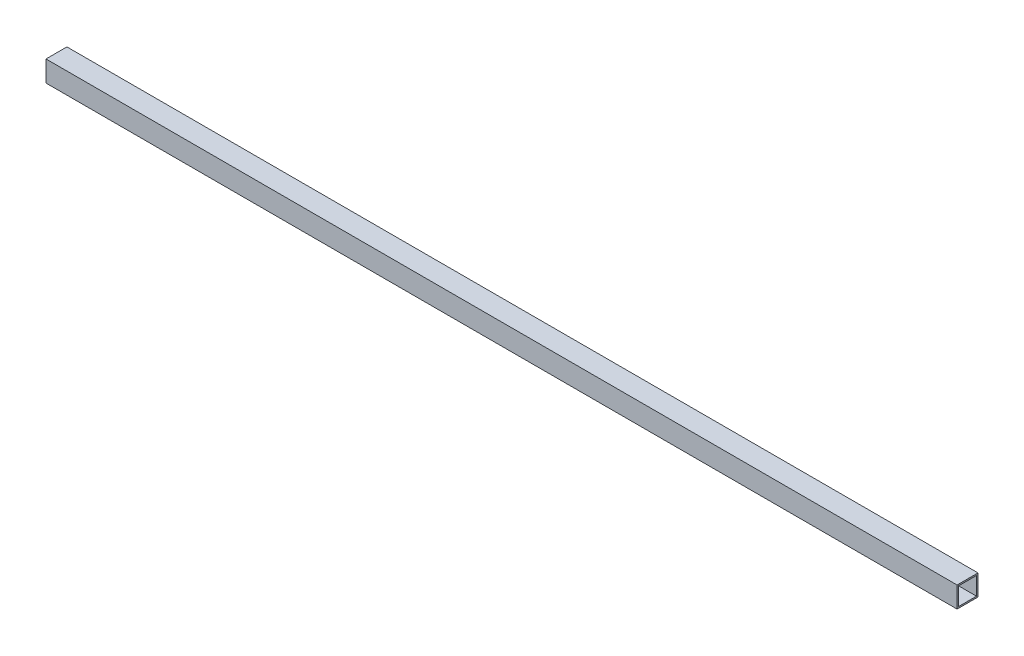
ISO-10303-21;
HEADER;
FILE_DESCRIPTION(('STEP AP214'),'2;1');
FILE_NAME('part.step','',(''),(''),'','','');
FILE_SCHEMA(('AUTOMOTIVE_DESIGN { 1 0 10303 214 1 1 1 1 }'));
ENDSEC;
DATA;
#1=APPLICATION_CONTEXT('core data for automotive mechanical design processes');
#2=APPLICATION_PROTOCOL_DEFINITION('international standard','automotive_design',2000,#1);
#3=PRODUCT_CONTEXT('',#1,'mechanical');
#4=PRODUCT('Part','Part','',(#3));
#5=PRODUCT_RELATED_PRODUCT_CATEGORY('part','',(#4));
#6=PRODUCT_DEFINITION_FORMATION('','',#4);
#7=PRODUCT_DEFINITION_CONTEXT('part definition',#1,'design');
#8=PRODUCT_DEFINITION('design','',#6,#7);
#9=PRODUCT_DEFINITION_SHAPE('','',#8);
#10=(LENGTH_UNIT() NAMED_UNIT(*) SI_UNIT(.MILLI.,.METRE.));
#11=(NAMED_UNIT(*) PLANE_ANGLE_UNIT() SI_UNIT($,.RADIAN.));
#12=(NAMED_UNIT(*) SI_UNIT($,.STERADIAN.) SOLID_ANGLE_UNIT());
#13=UNCERTAINTY_MEASURE_WITH_UNIT(LENGTH_MEASURE(1.E-05),#10,'distance_accuracy_value','');
#14=(GEOMETRIC_REPRESENTATION_CONTEXT(3) GLOBAL_UNCERTAINTY_ASSIGNED_CONTEXT((#13)) GLOBAL_UNIT_ASSIGNED_CONTEXT((#10,
#11,#12)) REPRESENTATION_CONTEXT('',''));
#15=CARTESIAN_POINT('',(0.,0.,0.));
#16=DIRECTION('',(0.,0.,1.));
#17=DIRECTION('',(1.,0.,0.));
#18=AXIS2_PLACEMENT_3D('',#15,#16,#17);
#19=CARTESIAN_POINT('',(1936.75,0.,0.));
#20=DIRECTION('',(-1.,0.,0.));
#21=DIRECTION('',(0.,0.,1.));
#22=AXIS2_PLACEMENT_3D('',#19,#20,#21);
#23=PLANE('',#22);
#24=DIRECTION('',(0.,-1.,0.));
#25=VECTOR('',#24,1.);
#26=CARTESIAN_POINT('',(1936.75,0.,0.));
#27=LINE('',#26,#25);
#28=CARTESIAN_POINT('',(1936.75,44.45,0.));
#29=VERTEX_POINT('',#28);
#30=CARTESIAN_POINT('',(1936.75,0.,0.));
#31=VERTEX_POINT('',#30);
#32=EDGE_CURVE('E138',#29,#31,#27,.T.);
#33=ORIENTED_EDGE('',*,*,#32,.T.);
#34=DIRECTION('',(0.,0.,-1.));
#35=VECTOR('',#34,1.);
#36=CARTESIAN_POINT('',(1936.75,0.,0.));
#37=LINE('',#36,#35);
#38=CARTESIAN_POINT('',(1936.75,0.,-44.45));
#39=VERTEX_POINT('',#38);
#40=EDGE_CURVE('E141',#31,#39,#37,.T.);
#41=ORIENTED_EDGE('',*,*,#40,.T.);
#42=DIRECTION('',(0.,1.,0.));
#43=VECTOR('',#42,1.);
#44=CARTESIAN_POINT('',(1936.75,0.,-44.45));
#45=LINE('',#44,#43);
#46=CARTESIAN_POINT('',(1936.75,44.45,-44.45));
#47=VERTEX_POINT('',#46);
#48=EDGE_CURVE('E144',#39,#47,#45,.T.);
#49=ORIENTED_EDGE('',*,*,#48,.T.);
#50=DIRECTION('',(0.,0.,1.));
#51=VECTOR('',#50,1.);
#52=CARTESIAN_POINT('',(1936.75,44.45,0.));
#53=LINE('',#52,#51);
#54=EDGE_CURVE('E146',#47,#29,#53,.T.);
#55=ORIENTED_EDGE('',*,*,#54,.T.);
#56=EDGE_LOOP('',(#33,#41,#49,#55));
#57=FACE_BOUND('',#56,.T.);
#58=DIRECTION('',(0.,-1.,0.));
#59=VECTOR('',#58,1.);
#60=CARTESIAN_POINT('',(1936.75,41.275,-3.175));
#61=LINE('',#60,#59);
#62=CARTESIAN_POINT('',(1936.75,41.275,-3.175));
#63=VERTEX_POINT('',#62);
#64=CARTESIAN_POINT('',(1936.75,3.175,-3.175));
#65=VERTEX_POINT('',#64);
#66=EDGE_CURVE('E102',#63,#65,#61,.T.);
#67=ORIENTED_EDGE('',*,*,#66,.F.);
#68=DIRECTION('',(0.,0.,1.));
#69=VECTOR('',#68,1.);
#70=CARTESIAN_POINT('',(1936.75,41.275,-3.175));
#71=LINE('',#70,#69);
#72=CARTESIAN_POINT('',(1936.75,41.275,-41.275));
#73=VERTEX_POINT('',#72);
#74=EDGE_CURVE('E124',#73,#63,#71,.T.);
#75=ORIENTED_EDGE('',*,*,#74,.F.);
#76=DIRECTION('',(0.,1.,0.));
#77=VECTOR('',#76,1.);
#78=CARTESIAN_POINT('',(1936.75,41.275,-41.275));
#79=LINE('',#78,#77);
#80=CARTESIAN_POINT('',(1936.75,3.175,-41.275));
#81=VERTEX_POINT('',#80);
#82=EDGE_CURVE('E122',#81,#73,#79,.T.);
#83=ORIENTED_EDGE('',*,*,#82,.F.);
#84=DIRECTION('',(0.,0.,-1.));
#85=VECTOR('',#84,1.);
#86=CARTESIAN_POINT('',(1936.75,3.175,-3.175));
#87=LINE('',#86,#85);
#88=EDGE_CURVE('E110',#65,#81,#87,.T.);
#89=ORIENTED_EDGE('',*,*,#88,.F.);
#90=EDGE_LOOP('',(#67,#75,#83,#89));
#91=FACE_BOUND('',#90,.T.);
#92=ADVANCED_FACE('F37',(#57,#91),#23,.F.);
#93=CARTESIAN_POINT('',(0.,0.,0.));
#94=DIRECTION('',(-1.,0.,0.));
#95=DIRECTION('',(0.,0.,1.));
#96=AXIS2_PLACEMENT_3D('',#93,#94,#95);
#97=PLANE('',#96);
#98=DIRECTION('',(0.,-1.,0.));
#99=VECTOR('',#98,1.);
#100=CARTESIAN_POINT('',(0.,0.,0.));
#101=LINE('',#100,#99);
#102=CARTESIAN_POINT('',(0.,44.45,0.));
#103=VERTEX_POINT('',#102);
#104=CARTESIAN_POINT('',(0.,0.,0.));
#105=VERTEX_POINT('',#104);
#106=EDGE_CURVE('E118',#103,#105,#101,.T.);
#107=ORIENTED_EDGE('',*,*,#106,.F.);
#108=DIRECTION('',(0.,0.,1.));
#109=VECTOR('',#108,1.);
#110=CARTESIAN_POINT('',(0.,44.45,0.));
#111=LINE('',#110,#109);
#112=CARTESIAN_POINT('',(0.,44.45,-44.45));
#113=VERTEX_POINT('',#112);
#114=EDGE_CURVE('E142',#113,#103,#111,.T.);
#115=ORIENTED_EDGE('',*,*,#114,.F.);
#116=DIRECTION('',(0.,1.,0.));
#117=VECTOR('',#116,1.);
#118=CARTESIAN_POINT('',(0.,0.,-44.45));
#119=LINE('',#118,#117);
#120=CARTESIAN_POINT('',(0.,0.,-44.45));
#121=VERTEX_POINT('',#120);
#122=EDGE_CURVE('E153',#121,#113,#119,.T.);
#123=ORIENTED_EDGE('',*,*,#122,.F.);
#124=DIRECTION('',(0.,0.,-1.));
#125=VECTOR('',#124,1.);
#126=CARTESIAN_POINT('',(0.,0.,0.));
#127=LINE('',#126,#125);
#128=EDGE_CURVE('E151',#105,#121,#127,.T.);
#129=ORIENTED_EDGE('',*,*,#128,.F.);
#130=EDGE_LOOP('',(#107,#115,#123,#129));
#131=FACE_BOUND('',#130,.T.);
#132=DIRECTION('',(0.,0.,1.));
#133=VECTOR('',#132,1.);
#134=CARTESIAN_POINT('',(0.,41.275,-3.175));
#135=LINE('',#134,#133);
#136=CARTESIAN_POINT('',(0.,41.275,-41.275));
#137=VERTEX_POINT('',#136);
#138=CARTESIAN_POINT('',(0.,41.275,-3.175));
#139=VERTEX_POINT('',#138);
#140=EDGE_CURVE('E111',#137,#139,#135,.T.);
#141=ORIENTED_EDGE('',*,*,#140,.T.);
#142=DIRECTION('',(0.,-1.,0.));
#143=VECTOR('',#142,1.);
#144=CARTESIAN_POINT('',(0.,41.275,-3.175));
#145=LINE('',#144,#143);
#146=CARTESIAN_POINT('',(0.,3.175,-3.175));
#147=VERTEX_POINT('',#146);
#148=EDGE_CURVE('E60',#139,#147,#145,.T.);
#149=ORIENTED_EDGE('',*,*,#148,.T.);
#150=DIRECTION('',(0.,0.,-1.));
#151=VECTOR('',#150,1.);
#152=CARTESIAN_POINT('',(0.,3.175,-3.175));
#153=LINE('',#152,#151);
#154=CARTESIAN_POINT('',(0.,3.175,-41.275));
#155=VERTEX_POINT('',#154);
#156=EDGE_CURVE('E117',#147,#155,#153,.T.);
#157=ORIENTED_EDGE('',*,*,#156,.T.);
#158=DIRECTION('',(0.,1.,0.));
#159=VECTOR('',#158,1.);
#160=CARTESIAN_POINT('',(0.,41.275,-41.275));
#161=LINE('',#160,#159);
#162=EDGE_CURVE('E130',#155,#137,#161,.T.);
#163=ORIENTED_EDGE('',*,*,#162,.T.);
#164=EDGE_LOOP('',(#141,#149,#157,#163));
#165=FACE_BOUND('',#164,.T.);
#166=ADVANCED_FACE('F171',(#131,#165),#97,.T.);
#167=CARTESIAN_POINT('',(1936.75,0.,0.));
#168=DIRECTION('',(0.,0.,-1.));
#169=DIRECTION('',(-1.,0.,0.));
#170=AXIS2_PLACEMENT_3D('',#167,#168,#169);
#171=PLANE('',#170);
#172=ORIENTED_EDGE('',*,*,#106,.T.);
#173=DIRECTION('',(-1.,0.,0.));
#174=VECTOR('',#173,1.);
#175=CARTESIAN_POINT('',(1936.75,0.,0.));
#176=LINE('',#175,#174);
#177=EDGE_CURVE('E11',#31,#105,#176,.T.);
#178=ORIENTED_EDGE('',*,*,#177,.F.);
#179=ORIENTED_EDGE('',*,*,#32,.F.);
#180=DIRECTION('',(-1.,0.,0.));
#181=VECTOR('',#180,1.);
#182=CARTESIAN_POINT('',(1936.75,44.45,0.));
#183=LINE('',#182,#181);
#184=EDGE_CURVE('E148',#29,#103,#183,.T.);
#185=ORIENTED_EDGE('',*,*,#184,.T.);
#186=EDGE_LOOP('',(#172,#178,#179,#185));
#187=FACE_BOUND('',#186,.T.);
#188=ADVANCED_FACE('F39',(#187),#171,.F.);
#189=CARTESIAN_POINT('',(1936.75,0.,0.));
#190=DIRECTION('',(0.,1.,0.));
#191=DIRECTION('',(0.,0.,1.));
#192=AXIS2_PLACEMENT_3D('',#189,#190,#191);
#193=PLANE('',#192);
#194=ORIENTED_EDGE('',*,*,#128,.T.);
#195=DIRECTION('',(-1.,0.,0.));
#196=VECTOR('',#195,1.);
#197=CARTESIAN_POINT('',(1936.75,0.,-44.45));
#198=LINE('',#197,#196);
#199=EDGE_CURVE('E45',#39,#121,#198,.T.);
#200=ORIENTED_EDGE('',*,*,#199,.F.);
#201=ORIENTED_EDGE('',*,*,#40,.F.);
#202=ORIENTED_EDGE('',*,*,#177,.T.);
#203=EDGE_LOOP('',(#194,#200,#201,#202));
#204=FACE_BOUND('',#203,.T.);
#205=ADVANCED_FACE('F181',(#204),#193,.F.);
#206=CARTESIAN_POINT('',(1936.75,0.,-44.45));
#207=DIRECTION('',(0.,0.,1.));
#208=DIRECTION('',(1.,0.,0.));
#209=AXIS2_PLACEMENT_3D('',#206,#207,#208);
#210=PLANE('',#209);
#211=ORIENTED_EDGE('',*,*,#122,.T.);
#212=DIRECTION('',(-1.,0.,0.));
#213=VECTOR('',#212,1.);
#214=CARTESIAN_POINT('',(1936.75,44.45,-44.45));
#215=LINE('',#214,#213);
#216=EDGE_CURVE('E158',#47,#113,#215,.T.);
#217=ORIENTED_EDGE('',*,*,#216,.F.);
#218=ORIENTED_EDGE('',*,*,#48,.F.);
#219=ORIENTED_EDGE('',*,*,#199,.T.);
#220=EDGE_LOOP('',(#211,#217,#218,#219));
#221=FACE_BOUND('',#220,.T.);
#222=ADVANCED_FACE('F165',(#221),#210,.F.);
#223=CARTESIAN_POINT('',(1936.75,44.45,0.));
#224=DIRECTION('',(0.,-1.,0.));
#225=DIRECTION('',(0.,0.,-1.));
#226=AXIS2_PLACEMENT_3D('',#223,#224,#225);
#227=PLANE('',#226);
#228=ORIENTED_EDGE('',*,*,#114,.T.);
#229=ORIENTED_EDGE('',*,*,#184,.F.);
#230=ORIENTED_EDGE('',*,*,#54,.F.);
#231=ORIENTED_EDGE('',*,*,#216,.T.);
#232=EDGE_LOOP('',(#228,#229,#230,#231));
#233=FACE_BOUND('',#232,.T.);
#234=ADVANCED_FACE('F175',(#233),#227,.F.);
#235=CARTESIAN_POINT('',(1936.75,41.275,-3.175));
#236=DIRECTION('',(0.,0.,-1.));
#237=DIRECTION('',(0.,1.,0.));
#238=AXIS2_PLACEMENT_3D('',#235,#236,#237);
#239=PLANE('',#238);
#240=ORIENTED_EDGE('',*,*,#148,.F.);
#241=DIRECTION('',(-1.,0.,0.));
#242=VECTOR('',#241,1.);
#243=CARTESIAN_POINT('',(1936.75,41.275,-3.175));
#244=LINE('',#243,#242);
#245=EDGE_CURVE('E106',#63,#139,#244,.T.);
#246=ORIENTED_EDGE('',*,*,#245,.F.);
#247=ORIENTED_EDGE('',*,*,#66,.T.);
#248=DIRECTION('',(-1.,0.,0.));
#249=VECTOR('',#248,1.);
#250=CARTESIAN_POINT('',(1936.75,3.175,-3.175));
#251=LINE('',#250,#249);
#252=EDGE_CURVE('E105',#65,#147,#251,.T.);
#253=ORIENTED_EDGE('',*,*,#252,.T.);
#254=EDGE_LOOP('',(#240,#246,#247,#253));
#255=FACE_BOUND('',#254,.T.);
#256=ADVANCED_FACE('F104',(#255),#239,.T.);
#257=CARTESIAN_POINT('',(1936.75,3.175,-3.175));
#258=DIRECTION('',(0.,1.,0.));
#259=DIRECTION('',(0.,0.,1.));
#260=AXIS2_PLACEMENT_3D('',#257,#258,#259);
#261=PLANE('',#260);
#262=ORIENTED_EDGE('',*,*,#156,.F.);
#263=ORIENTED_EDGE('',*,*,#252,.F.);
#264=ORIENTED_EDGE('',*,*,#88,.T.);
#265=DIRECTION('',(-1.,0.,0.));
#266=VECTOR('',#265,1.);
#267=CARTESIAN_POINT('',(1936.75,3.175,-41.275));
#268=LINE('',#267,#266);
#269=EDGE_CURVE('E119',#81,#155,#268,.T.);
#270=ORIENTED_EDGE('',*,*,#269,.T.);
#271=EDGE_LOOP('',(#262,#263,#264,#270));
#272=FACE_BOUND('',#271,.T.);
#273=ADVANCED_FACE('F114',(#272),#261,.T.);
#274=CARTESIAN_POINT('',(1936.75,41.275,-41.275));
#275=DIRECTION('',(0.,0.,1.));
#276=DIRECTION('',(0.,-1.,0.));
#277=AXIS2_PLACEMENT_3D('',#274,#275,#276);
#278=PLANE('',#277);
#279=ORIENTED_EDGE('',*,*,#162,.F.);
#280=ORIENTED_EDGE('',*,*,#269,.F.);
#281=ORIENTED_EDGE('',*,*,#82,.T.);
#282=DIRECTION('',(-1.,0.,0.));
#283=VECTOR('',#282,1.);
#284=CARTESIAN_POINT('',(1936.75,41.275,-41.275));
#285=LINE('',#284,#283);
#286=EDGE_CURVE('E52',#73,#137,#285,.T.);
#287=ORIENTED_EDGE('',*,*,#286,.T.);
#288=EDGE_LOOP('',(#279,#280,#281,#287));
#289=FACE_BOUND('',#288,.T.);
#290=ADVANCED_FACE('F204',(#289),#278,.T.);
#291=CARTESIAN_POINT('',(1936.75,41.275,-3.175));
#292=DIRECTION('',(0.,-1.,0.));
#293=DIRECTION('',(0.,0.,-1.));
#294=AXIS2_PLACEMENT_3D('',#291,#292,#293);
#295=PLANE('',#294);
#296=ORIENTED_EDGE('',*,*,#140,.F.);
#297=ORIENTED_EDGE('',*,*,#286,.F.);
#298=ORIENTED_EDGE('',*,*,#74,.T.);
#299=ORIENTED_EDGE('',*,*,#245,.T.);
#300=EDGE_LOOP('',(#296,#297,#298,#299));
#301=FACE_BOUND('',#300,.T.);
#302=ADVANCED_FACE('F208',(#301),#295,.T.);
#303=CLOSED_SHELL('',(#92,#166,#188,#205,#222,#234,#256,#273,#290,#302));
#304=MANIFOLD_SOLID_BREP('B2',#303);
#305=ADVANCED_BREP_SHAPE_REPRESENTATION('',(#18,#304),#14);
#306=SHAPE_DEFINITION_REPRESENTATION(#9,#305);
ENDSEC;
END-ISO-10303-21;
